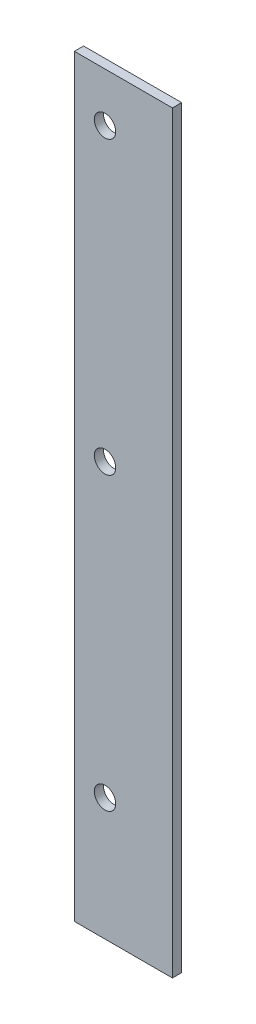
ISO-10303-21;
HEADER;
FILE_DESCRIPTION(('STEP AP214'),'2;1');
FILE_NAME('part.step','',(''),(''),'','','');
FILE_SCHEMA(('AUTOMOTIVE_DESIGN { 1 0 10303 214 1 1 1 1 }'));
ENDSEC;
DATA;
#1=APPLICATION_CONTEXT('core data for automotive mechanical design processes');
#2=APPLICATION_PROTOCOL_DEFINITION('international standard','automotive_design',2000,#1);
#3=PRODUCT_CONTEXT('',#1,'mechanical');
#4=PRODUCT('Part','Part','',(#3));
#5=PRODUCT_RELATED_PRODUCT_CATEGORY('part','',(#4));
#6=PRODUCT_DEFINITION_FORMATION('','',#4);
#7=PRODUCT_DEFINITION_CONTEXT('part definition',#1,'design');
#8=PRODUCT_DEFINITION('design','',#6,#7);
#9=PRODUCT_DEFINITION_SHAPE('','',#8);
#10=(LENGTH_UNIT() NAMED_UNIT(*) SI_UNIT(.MILLI.,.METRE.));
#11=(NAMED_UNIT(*) PLANE_ANGLE_UNIT() SI_UNIT($,.RADIAN.));
#12=(NAMED_UNIT(*) SI_UNIT($,.STERADIAN.) SOLID_ANGLE_UNIT());
#13=UNCERTAINTY_MEASURE_WITH_UNIT(LENGTH_MEASURE(1.E-05),#10,'distance_accuracy_value','');
#14=(GEOMETRIC_REPRESENTATION_CONTEXT(3) GLOBAL_UNCERTAINTY_ASSIGNED_CONTEXT((#13)) GLOBAL_UNIT_ASSIGNED_CONTEXT((#10,
#11,#12)) REPRESENTATION_CONTEXT('',''));
#15=CARTESIAN_POINT('',(0.,0.,0.));
#16=DIRECTION('',(0.,0.,1.));
#17=DIRECTION('',(1.,0.,0.));
#18=AXIS2_PLACEMENT_3D('',#15,#16,#17);
#19=CARTESIAN_POINT('',(5.,115.,0.));
#20=DIRECTION('',(0.,0.,1.));
#21=DIRECTION('',(1.,0.,0.));
#22=AXIS2_PLACEMENT_3D('',#19,#20,#21);
#23=CYLINDRICAL_SURFACE('',#22,1.75);
#24=CARTESIAN_POINT('',(5.,115.,0.));
#25=DIRECTION('',(0.,0.,1.));
#26=DIRECTION('',(1.,0.,0.));
#27=AXIS2_PLACEMENT_3D('',#24,#25,#26);
#28=CIRCLE('',#27,1.75);
#29=CARTESIAN_POINT('',(6.75,115.,0.));
#30=VERTEX_POINT('',#29);
#31=EDGE_CURVE('E41',#30,#30,#28,.T.);
#32=ORIENTED_EDGE('',*,*,#31,.F.);
#33=EDGE_LOOP('',(#32));
#34=FACE_BOUND('',#33,.T.);
#35=CARTESIAN_POINT('',(5.,115.,1.5));
#36=DIRECTION('',(0.,0.,1.));
#37=DIRECTION('',(1.,0.,0.));
#38=AXIS2_PLACEMENT_3D('',#35,#36,#37);
#39=CIRCLE('',#38,1.75);
#40=CARTESIAN_POINT('',(6.75,115.,1.5));
#41=VERTEX_POINT('',#40);
#42=EDGE_CURVE('E11',#41,#41,#39,.T.);
#43=ORIENTED_EDGE('',*,*,#42,.T.);
#44=EDGE_LOOP('',(#43));
#45=FACE_BOUND('',#44,.T.);
#46=ADVANCED_FACE('F33',(#34,#45),#23,.F.);
#47=CARTESIAN_POINT('',(0.,0.,1.5));
#48=DIRECTION('',(1.,0.,0.));
#49=DIRECTION('',(0.,0.,-1.));
#50=AXIS2_PLACEMENT_3D('',#47,#48,#49);
#51=PLANE('',#50);
#52=DIRECTION('',(0.,-1.,0.));
#53=VECTOR('',#52,1.);
#54=CARTESIAN_POINT('',(0.,0.,0.));
#55=LINE('',#54,#53);
#56=CARTESIAN_POINT('',(0.,123.,0.));
#57=VERTEX_POINT('',#56);
#58=CARTESIAN_POINT('',(0.,0.,0.));
#59=VERTEX_POINT('',#58);
#60=EDGE_CURVE('E101',#57,#59,#55,.T.);
#61=ORIENTED_EDGE('',*,*,#60,.T.);
#62=DIRECTION('',(0.,0.,-1.));
#63=VECTOR('',#62,1.);
#64=CARTESIAN_POINT('',(0.,0.,1.5));
#65=LINE('',#64,#63);
#66=CARTESIAN_POINT('',(0.,0.,1.5));
#67=VERTEX_POINT('',#66);
#68=EDGE_CURVE('E92',#67,#59,#65,.T.);
#69=ORIENTED_EDGE('',*,*,#68,.F.);
#70=DIRECTION('',(0.,-1.,0.));
#71=VECTOR('',#70,1.);
#72=CARTESIAN_POINT('',(0.,0.,1.5));
#73=LINE('',#72,#71);
#74=CARTESIAN_POINT('',(0.,123.,1.5));
#75=VERTEX_POINT('',#74);
#76=EDGE_CURVE('E86',#75,#67,#73,.T.);
#77=ORIENTED_EDGE('',*,*,#76,.F.);
#78=DIRECTION('',(0.,0.,-1.));
#79=VECTOR('',#78,1.);
#80=CARTESIAN_POINT('',(0.,123.,1.5));
#81=LINE('',#80,#79);
#82=EDGE_CURVE('E97',#75,#57,#81,.T.);
#83=ORIENTED_EDGE('',*,*,#82,.T.);
#84=EDGE_LOOP('',(#61,#69,#77,#83));
#85=FACE_BOUND('',#84,.T.);
#86=ADVANCED_FACE('F117',(#85),#51,.F.);
#87=CARTESIAN_POINT('',(0.,0.,1.5));
#88=DIRECTION('',(0.,1.,0.));
#89=DIRECTION('',(0.,0.,1.));
#90=AXIS2_PLACEMENT_3D('',#87,#88,#89);
#91=PLANE('',#90);
#92=DIRECTION('',(1.,0.,0.));
#93=VECTOR('',#92,1.);
#94=CARTESIAN_POINT('',(0.,0.,0.));
#95=LINE('',#94,#93);
#96=CARTESIAN_POINT('',(16.,0.,0.));
#97=VERTEX_POINT('',#96);
#98=EDGE_CURVE('E91',#59,#97,#95,.T.);
#99=ORIENTED_EDGE('',*,*,#98,.T.);
#100=DIRECTION('',(0.,0.,-1.));
#101=VECTOR('',#100,1.);
#102=CARTESIAN_POINT('',(16.,0.,1.5));
#103=LINE('',#102,#101);
#104=CARTESIAN_POINT('',(16.,0.,1.5));
#105=VERTEX_POINT('',#104);
#106=EDGE_CURVE('E89',#105,#97,#103,.T.);
#107=ORIENTED_EDGE('',*,*,#106,.F.);
#108=DIRECTION('',(1.,0.,0.));
#109=VECTOR('',#108,1.);
#110=CARTESIAN_POINT('',(0.,0.,1.5));
#111=LINE('',#110,#109);
#112=EDGE_CURVE('E80',#67,#105,#111,.T.);
#113=ORIENTED_EDGE('',*,*,#112,.F.);
#114=ORIENTED_EDGE('',*,*,#68,.T.);
#115=EDGE_LOOP('',(#99,#107,#113,#114));
#116=FACE_BOUND('',#115,.T.);
#117=ADVANCED_FACE('F90',(#116),#91,.F.);
#118=CARTESIAN_POINT('',(16.,0.,1.5));
#119=DIRECTION('',(-1.,0.,0.));
#120=DIRECTION('',(0.,0.,1.));
#121=AXIS2_PLACEMENT_3D('',#118,#119,#120);
#122=PLANE('',#121);
#123=DIRECTION('',(0.,1.,0.));
#124=VECTOR('',#123,1.);
#125=CARTESIAN_POINT('',(16.,0.,0.));
#126=LINE('',#125,#124);
#127=CARTESIAN_POINT('',(16.,123.,0.));
#128=VERTEX_POINT('',#127);
#129=EDGE_CURVE('E66',#97,#128,#126,.T.);
#130=ORIENTED_EDGE('',*,*,#129,.T.);
#131=DIRECTION('',(0.,0.,-1.));
#132=VECTOR('',#131,1.);
#133=CARTESIAN_POINT('',(16.,123.,1.5));
#134=LINE('',#133,#132);
#135=CARTESIAN_POINT('',(16.,123.,1.5));
#136=VERTEX_POINT('',#135);
#137=EDGE_CURVE('E93',#136,#128,#134,.T.);
#138=ORIENTED_EDGE('',*,*,#137,.F.);
#139=DIRECTION('',(0.,1.,0.));
#140=VECTOR('',#139,1.);
#141=CARTESIAN_POINT('',(16.,0.,1.5));
#142=LINE('',#141,#140);
#143=EDGE_CURVE('E84',#105,#136,#142,.T.);
#144=ORIENTED_EDGE('',*,*,#143,.F.);
#145=ORIENTED_EDGE('',*,*,#106,.T.);
#146=EDGE_LOOP('',(#130,#138,#144,#145));
#147=FACE_BOUND('',#146,.T.);
#148=ADVANCED_FACE('F95',(#147),#122,.F.);
#149=CARTESIAN_POINT('',(0.,123.,1.5));
#150=DIRECTION('',(0.,-1.,0.));
#151=DIRECTION('',(0.,0.,-1.));
#152=AXIS2_PLACEMENT_3D('',#149,#150,#151);
#153=PLANE('',#152);
#154=DIRECTION('',(-1.,0.,0.));
#155=VECTOR('',#154,1.);
#156=CARTESIAN_POINT('',(0.,123.,0.));
#157=LINE('',#156,#155);
#158=EDGE_CURVE('E72',#128,#57,#157,.T.);
#159=ORIENTED_EDGE('',*,*,#158,.T.);
#160=ORIENTED_EDGE('',*,*,#82,.F.);
#161=DIRECTION('',(-1.,0.,0.));
#162=VECTOR('',#161,1.);
#163=CARTESIAN_POINT('',(0.,123.,1.5));
#164=LINE('',#163,#162);
#165=EDGE_CURVE('E49',#136,#75,#164,.T.);
#166=ORIENTED_EDGE('',*,*,#165,.F.);
#167=ORIENTED_EDGE('',*,*,#137,.T.);
#168=EDGE_LOOP('',(#159,#160,#166,#167));
#169=FACE_BOUND('',#168,.T.);
#170=ADVANCED_FACE('F120',(#169),#153,.F.);
#171=CARTESIAN_POINT('',(0.,0.,1.5));
#172=DIRECTION('',(0.,0.,-1.));
#173=DIRECTION('',(-1.,0.,0.));
#174=AXIS2_PLACEMENT_3D('',#171,#172,#173);
#175=PLANE('',#174);
#176=CARTESIAN_POINT('',(5.,67.5,1.5));
#177=DIRECTION('',(0.,0.,1.));
#178=DIRECTION('',(1.,0.,0.));
#179=AXIS2_PLACEMENT_3D('',#176,#177,#178);
#180=CIRCLE('',#179,1.75);
#181=CARTESIAN_POINT('',(6.75,67.5,1.5));
#182=VERTEX_POINT('',#181);
#183=EDGE_CURVE('E149',#182,#182,#180,.T.);
#184=ORIENTED_EDGE('',*,*,#183,.F.);
#185=EDGE_LOOP('',(#184));
#186=FACE_BOUND('',#185,.T.);
#187=CARTESIAN_POINT('',(5.,20.,1.5));
#188=DIRECTION('',(0.,0.,1.));
#189=DIRECTION('',(1.,0.,0.));
#190=AXIS2_PLACEMENT_3D('',#187,#188,#189);
#191=CIRCLE('',#190,1.75);
#192=CARTESIAN_POINT('',(6.75,20.,1.5));
#193=VERTEX_POINT('',#192);
#194=EDGE_CURVE('E146',#193,#193,#191,.T.);
#195=ORIENTED_EDGE('',*,*,#194,.F.);
#196=EDGE_LOOP('',(#195));
#197=FACE_BOUND('',#196,.T.);
#198=ORIENTED_EDGE('',*,*,#76,.T.);
#199=ORIENTED_EDGE('',*,*,#112,.T.);
#200=ORIENTED_EDGE('',*,*,#143,.T.);
#201=ORIENTED_EDGE('',*,*,#165,.T.);
#202=EDGE_LOOP('',(#198,#199,#200,#201));
#203=FACE_BOUND('',#202,.T.);
#204=ORIENTED_EDGE('',*,*,#42,.F.);
#205=EDGE_LOOP('',(#204));
#206=FACE_BOUND('',#205,.T.);
#207=ADVANCED_FACE('F81',(#186,#197,#203,#206),#175,.F.);
#208=CARTESIAN_POINT('',(0.,0.,0.));
#209=DIRECTION('',(0.,0.,-1.));
#210=DIRECTION('',(-1.,0.,0.));
#211=AXIS2_PLACEMENT_3D('',#208,#209,#210);
#212=PLANE('',#211);
#213=CARTESIAN_POINT('',(5.,67.5,0.));
#214=DIRECTION('',(0.,0.,1.));
#215=DIRECTION('',(1.,0.,0.));
#216=AXIS2_PLACEMENT_3D('',#213,#214,#215);
#217=CIRCLE('',#216,1.75);
#218=CARTESIAN_POINT('',(6.75,67.5,0.));
#219=VERTEX_POINT('',#218);
#220=EDGE_CURVE('E154',#219,#219,#217,.T.);
#221=ORIENTED_EDGE('',*,*,#220,.T.);
#222=EDGE_LOOP('',(#221));
#223=FACE_BOUND('',#222,.T.);
#224=CARTESIAN_POINT('',(5.,20.,0.));
#225=DIRECTION('',(0.,0.,1.));
#226=DIRECTION('',(1.,0.,0.));
#227=AXIS2_PLACEMENT_3D('',#224,#225,#226);
#228=CIRCLE('',#227,1.75);
#229=CARTESIAN_POINT('',(6.75,20.,0.));
#230=VERTEX_POINT('',#229);
#231=EDGE_CURVE('E104',#230,#230,#228,.T.);
#232=ORIENTED_EDGE('',*,*,#231,.T.);
#233=EDGE_LOOP('',(#232));
#234=FACE_BOUND('',#233,.T.);
#235=ORIENTED_EDGE('',*,*,#60,.F.);
#236=ORIENTED_EDGE('',*,*,#158,.F.);
#237=ORIENTED_EDGE('',*,*,#129,.F.);
#238=ORIENTED_EDGE('',*,*,#98,.F.);
#239=EDGE_LOOP('',(#235,#236,#237,#238));
#240=FACE_BOUND('',#239,.T.);
#241=ORIENTED_EDGE('',*,*,#31,.T.);
#242=EDGE_LOOP('',(#241));
#243=FACE_BOUND('',#242,.T.);
#244=ADVANCED_FACE('F113',(#223,#234,#240,#243),#212,.T.);
#245=CARTESIAN_POINT('',(5.,20.,0.));
#246=DIRECTION('',(0.,0.,1.));
#247=DIRECTION('',(1.,0.,0.));
#248=AXIS2_PLACEMENT_3D('',#245,#246,#247);
#249=CYLINDRICAL_SURFACE('',#248,1.75);
#250=ORIENTED_EDGE('',*,*,#231,.F.);
#251=EDGE_LOOP('',(#250));
#252=FACE_BOUND('',#251,.T.);
#253=ORIENTED_EDGE('',*,*,#194,.T.);
#254=EDGE_LOOP('',(#253));
#255=FACE_BOUND('',#254,.T.);
#256=ADVANCED_FACE('F127',(#252,#255),#249,.F.);
#257=CARTESIAN_POINT('',(5.,67.5,0.));
#258=DIRECTION('',(0.,0.,1.));
#259=DIRECTION('',(1.,0.,0.));
#260=AXIS2_PLACEMENT_3D('',#257,#258,#259);
#261=CYLINDRICAL_SURFACE('',#260,1.75);
#262=ORIENTED_EDGE('',*,*,#220,.F.);
#263=EDGE_LOOP('',(#262));
#264=FACE_BOUND('',#263,.T.);
#265=ORIENTED_EDGE('',*,*,#183,.T.);
#266=EDGE_LOOP('',(#265));
#267=FACE_BOUND('',#266,.T.);
#268=ADVANCED_FACE('F159',(#264,#267),#261,.F.);
#269=CLOSED_SHELL('',(#46,#86,#117,#148,#170,#207,#244,#256,#268));
#270=MANIFOLD_SOLID_BREP('B2',#269);
#271=ADVANCED_BREP_SHAPE_REPRESENTATION('',(#18,#270),#14);
#272=SHAPE_DEFINITION_REPRESENTATION(#9,#271);
ENDSEC;
END-ISO-10303-21;
